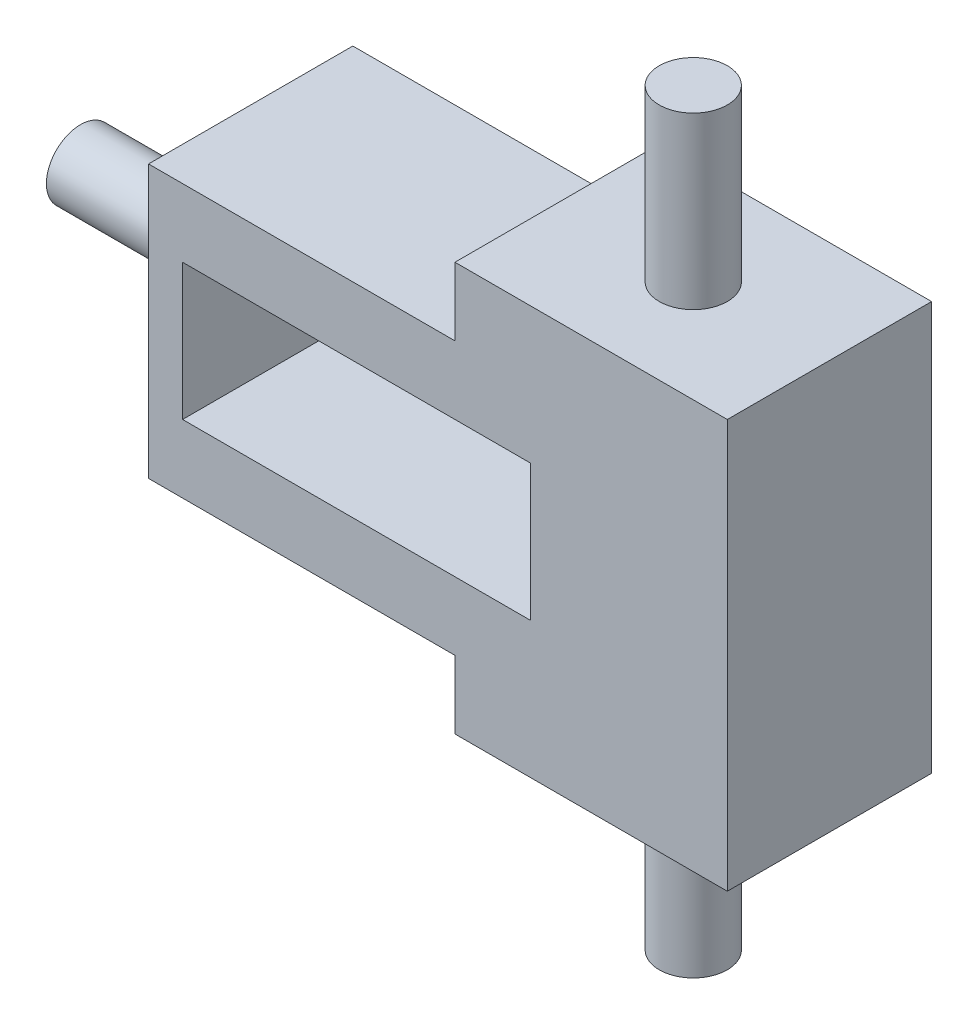
ISO-10303-21;
HEADER;
FILE_DESCRIPTION(('STEP AP214'),'2;1');
FILE_NAME('part.step','',(''),(''),'','','');
FILE_SCHEMA(('AUTOMOTIVE_DESIGN { 1 0 10303 214 1 1 1 1 }'));
ENDSEC;
DATA;
#1=APPLICATION_CONTEXT('core data for automotive mechanical design processes');
#2=APPLICATION_PROTOCOL_DEFINITION('international standard','automotive_design',2000,#1);
#3=PRODUCT_CONTEXT('',#1,'mechanical');
#4=PRODUCT('Part','Part','',(#3));
#5=PRODUCT_RELATED_PRODUCT_CATEGORY('part','',(#4));
#6=PRODUCT_DEFINITION_FORMATION('','',#4);
#7=PRODUCT_DEFINITION_CONTEXT('part definition',#1,'design');
#8=PRODUCT_DEFINITION('design','',#6,#7);
#9=PRODUCT_DEFINITION_SHAPE('','',#8);
#10=(LENGTH_UNIT() NAMED_UNIT(*) SI_UNIT(.MILLI.,.METRE.));
#11=(NAMED_UNIT(*) PLANE_ANGLE_UNIT() SI_UNIT($,.RADIAN.));
#12=(NAMED_UNIT(*) SI_UNIT($,.STERADIAN.) SOLID_ANGLE_UNIT());
#13=UNCERTAINTY_MEASURE_WITH_UNIT(LENGTH_MEASURE(1.E-05),#10,'distance_accuracy_value','');
#14=(GEOMETRIC_REPRESENTATION_CONTEXT(3) GLOBAL_UNCERTAINTY_ASSIGNED_CONTEXT((#13)) GLOBAL_UNIT_ASSIGNED_CONTEXT((#10,
#11,#12)) REPRESENTATION_CONTEXT('',''));
#15=CARTESIAN_POINT('',(0.,0.,0.));
#16=DIRECTION('',(0.,0.,1.));
#17=DIRECTION('',(1.,0.,0.));
#18=AXIS2_PLACEMENT_3D('',#15,#16,#17);
#19=CARTESIAN_POINT('',(0.,0.,3.));
#20=DIRECTION('',(0.,0.,1.));
#21=DIRECTION('',(1.,0.,0.));
#22=AXIS2_PLACEMENT_3D('',#19,#20,#21);
#23=PLANE('',#22);
#24=DIRECTION('',(-1.,0.,0.));
#25=VECTOR('',#24,1.);
#26=CARTESIAN_POINT('',(-2.5,2.,3.));
#27=LINE('',#26,#25);
#28=CARTESIAN_POINT('',(2.,2.,3.));
#29=VERTEX_POINT('',#28);
#30=CARTESIAN_POINT('',(-2.5,2.,3.));
#31=VERTEX_POINT('',#30);
#32=EDGE_CURVE('E181',#29,#31,#27,.T.);
#33=ORIENTED_EDGE('',*,*,#32,.T.);
#34=DIRECTION('',(0.,-1.,0.));
#35=VECTOR('',#34,1.);
#36=CARTESIAN_POINT('',(-2.5,0.50354609929078,3.));
#37=LINE('',#36,#35);
#38=CARTESIAN_POINT('',(-2.5,-2.,3.));
#39=VERTEX_POINT('',#38);
#40=EDGE_CURVE('E185',#31,#39,#37,.T.);
#41=ORIENTED_EDGE('',*,*,#40,.T.);
#42=DIRECTION('',(1.,0.,0.));
#43=VECTOR('',#42,1.);
#44=CARTESIAN_POINT('',(-2.,-2.,3.));
#45=LINE('',#44,#43);
#46=CARTESIAN_POINT('',(2.,-2.,3.));
#47=VERTEX_POINT('',#46);
#48=EDGE_CURVE('E189',#39,#47,#45,.T.);
#49=ORIENTED_EDGE('',*,*,#48,.T.);
#50=DIRECTION('',(0.,-1.,0.));
#51=VECTOR('',#50,1.);
#52=CARTESIAN_POINT('',(2.,-3.,3.));
#53=LINE('',#52,#51);
#54=CARTESIAN_POINT('',(2.,-3.,3.));
#55=VERTEX_POINT('',#54);
#56=EDGE_CURVE('E192',#47,#55,#53,.T.);
#57=ORIENTED_EDGE('',*,*,#56,.T.);
#58=DIRECTION('',(1.,0.,0.));
#59=VECTOR('',#58,1.);
#60=CARTESIAN_POINT('',(6.,-3.,3.));
#61=LINE('',#60,#59);
#62=CARTESIAN_POINT('',(6.,-3.,3.));
#63=VERTEX_POINT('',#62);
#64=EDGE_CURVE('E195',#55,#63,#61,.T.);
#65=ORIENTED_EDGE('',*,*,#64,.T.);
#66=DIRECTION('',(0.,1.,0.));
#67=VECTOR('',#66,1.);
#68=CARTESIAN_POINT('',(6.,3.,3.));
#69=LINE('',#68,#67);
#70=CARTESIAN_POINT('',(6.,3.,3.));
#71=VERTEX_POINT('',#70);
#72=EDGE_CURVE('E198',#63,#71,#69,.T.);
#73=ORIENTED_EDGE('',*,*,#72,.T.);
#74=DIRECTION('',(-1.,0.,0.));
#75=VECTOR('',#74,1.);
#76=CARTESIAN_POINT('',(2.,3.,3.));
#77=LINE('',#76,#75);
#78=CARTESIAN_POINT('',(2.,3.,3.));
#79=VERTEX_POINT('',#78);
#80=EDGE_CURVE('E201',#71,#79,#77,.T.);
#81=ORIENTED_EDGE('',*,*,#80,.T.);
#82=DIRECTION('',(0.,-1.,0.));
#83=VECTOR('',#82,1.);
#84=CARTESIAN_POINT('',(2.,2.,3.));
#85=LINE('',#84,#83);
#86=EDGE_CURVE('E204',#79,#29,#85,.T.);
#87=ORIENTED_EDGE('',*,*,#86,.T.);
#88=EDGE_LOOP('',(#33,#41,#49,#57,#65,#73,#81,#87));
#89=FACE_BOUND('',#88,.T.);
#90=DIRECTION('',(0.,-1.,0.));
#91=VECTOR('',#90,1.);
#92=CARTESIAN_POINT('',(-2.,1.,3.));
#93=LINE('',#92,#91);
#94=CARTESIAN_POINT('',(-2.,1.,3.));
#95=VERTEX_POINT('',#94);
#96=CARTESIAN_POINT('',(-2.,-1.,3.));
#97=VERTEX_POINT('',#96);
#98=EDGE_CURVE('E140',#95,#97,#93,.T.);
#99=ORIENTED_EDGE('',*,*,#98,.F.);
#100=DIRECTION('',(-1.,0.,0.));
#101=VECTOR('',#100,1.);
#102=CARTESIAN_POINT('',(-2.,1.,3.));
#103=LINE('',#102,#101);
#104=CARTESIAN_POINT('',(3.10638297872341,1.,3.));
#105=VERTEX_POINT('',#104);
#106=EDGE_CURVE('E131',#105,#95,#103,.T.);
#107=ORIENTED_EDGE('',*,*,#106,.F.);
#108=DIRECTION('',(0.,1.,0.));
#109=VECTOR('',#108,1.);
#110=CARTESIAN_POINT('',(3.10638297872341,1.,3.));
#111=LINE('',#110,#109);
#112=CARTESIAN_POINT('',(3.10638297872341,-1.,3.));
#113=VERTEX_POINT('',#112);
#114=EDGE_CURVE('E157',#113,#105,#111,.T.);
#115=ORIENTED_EDGE('',*,*,#114,.F.);
#116=DIRECTION('',(1.,0.,0.));
#117=VECTOR('',#116,1.);
#118=CARTESIAN_POINT('',(3.10638297872341,-1.,3.));
#119=LINE('',#118,#117);
#120=EDGE_CURVE('E153',#97,#113,#119,.T.);
#121=ORIENTED_EDGE('',*,*,#120,.F.);
#122=EDGE_LOOP('',(#99,#107,#115,#121));
#123=FACE_BOUND('',#122,.T.);
#124=ADVANCED_FACE('F39',(#89,#123),#23,.T.);
#125=CARTESIAN_POINT('',(0.,0.,0.));
#126=DIRECTION('',(0.,0.,1.));
#127=DIRECTION('',(1.,0.,0.));
#128=AXIS2_PLACEMENT_3D('',#125,#126,#127);
#129=PLANE('',#128);
#130=DIRECTION('',(0.,-1.,0.));
#131=VECTOR('',#130,1.);
#132=CARTESIAN_POINT('',(-2.5,-2.,0.));
#133=LINE('',#132,#131);
#134=CARTESIAN_POINT('',(-2.5,2.,0.));
#135=VERTEX_POINT('',#134);
#136=CARTESIAN_POINT('',(-2.5,-2.,0.));
#137=VERTEX_POINT('',#136);
#138=EDGE_CURVE('E149',#135,#137,#133,.T.);
#139=ORIENTED_EDGE('',*,*,#138,.F.);
#140=DIRECTION('',(-1.,0.,0.));
#141=VECTOR('',#140,1.);
#142=CARTESIAN_POINT('',(-2.,2.,0.));
#143=LINE('',#142,#141);
#144=CARTESIAN_POINT('',(2.,2.,0.));
#145=VERTEX_POINT('',#144);
#146=EDGE_CURVE('E186',#145,#135,#143,.T.);
#147=ORIENTED_EDGE('',*,*,#146,.F.);
#148=DIRECTION('',(0.,-1.,0.));
#149=VECTOR('',#148,1.);
#150=CARTESIAN_POINT('',(2.,2.,0.));
#151=LINE('',#150,#149);
#152=CARTESIAN_POINT('',(2.,3.,0.));
#153=VERTEX_POINT('',#152);
#154=EDGE_CURVE('E227',#153,#145,#151,.T.);
#155=ORIENTED_EDGE('',*,*,#154,.F.);
#156=DIRECTION('',(-1.,0.,0.));
#157=VECTOR('',#156,1.);
#158=CARTESIAN_POINT('',(2.,3.,0.));
#159=LINE('',#158,#157);
#160=CARTESIAN_POINT('',(6.,3.,0.));
#161=VERTEX_POINT('',#160);
#162=EDGE_CURVE('E224',#161,#153,#159,.T.);
#163=ORIENTED_EDGE('',*,*,#162,.F.);
#164=DIRECTION('',(0.,1.,0.));
#165=VECTOR('',#164,1.);
#166=CARTESIAN_POINT('',(6.,3.,0.));
#167=LINE('',#166,#165);
#168=CARTESIAN_POINT('',(6.,-3.,0.));
#169=VERTEX_POINT('',#168);
#170=EDGE_CURVE('E221',#169,#161,#167,.T.);
#171=ORIENTED_EDGE('',*,*,#170,.F.);
#172=DIRECTION('',(1.,0.,0.));
#173=VECTOR('',#172,1.);
#174=CARTESIAN_POINT('',(6.,-3.,0.));
#175=LINE('',#174,#173);
#176=CARTESIAN_POINT('',(2.,-3.,0.));
#177=VERTEX_POINT('',#176);
#178=EDGE_CURVE('E218',#177,#169,#175,.T.);
#179=ORIENTED_EDGE('',*,*,#178,.F.);
#180=DIRECTION('',(0.,-1.,0.));
#181=VECTOR('',#180,1.);
#182=CARTESIAN_POINT('',(2.,-3.,0.));
#183=LINE('',#182,#181);
#184=CARTESIAN_POINT('',(2.,-2.,0.));
#185=VERTEX_POINT('',#184);
#186=EDGE_CURVE('E215',#185,#177,#183,.T.);
#187=ORIENTED_EDGE('',*,*,#186,.F.);
#188=DIRECTION('',(1.,0.,0.));
#189=VECTOR('',#188,1.);
#190=CARTESIAN_POINT('',(2.,-2.,0.));
#191=LINE('',#190,#189);
#192=EDGE_CURVE('E212',#137,#185,#191,.T.);
#193=ORIENTED_EDGE('',*,*,#192,.F.);
#194=EDGE_LOOP('',(#139,#147,#155,#163,#171,#179,#187,#193));
#195=FACE_BOUND('',#194,.T.);
#196=DIRECTION('',(-1.,0.,0.));
#197=VECTOR('',#196,1.);
#198=CARTESIAN_POINT('',(-2.,1.,0.));
#199=LINE('',#198,#197);
#200=CARTESIAN_POINT('',(3.10638297872341,1.,0.));
#201=VERTEX_POINT('',#200);
#202=CARTESIAN_POINT('',(-2.,1.,0.));
#203=VERTEX_POINT('',#202);
#204=EDGE_CURVE('E65',#201,#203,#199,.T.);
#205=ORIENTED_EDGE('',*,*,#204,.T.);
#206=DIRECTION('',(0.,-1.,0.));
#207=VECTOR('',#206,1.);
#208=CARTESIAN_POINT('',(-2.,1.,0.));
#209=LINE('',#208,#207);
#210=CARTESIAN_POINT('',(-2.,-1.,0.));
#211=VERTEX_POINT('',#210);
#212=EDGE_CURVE('E147',#203,#211,#209,.T.);
#213=ORIENTED_EDGE('',*,*,#212,.T.);
#214=DIRECTION('',(1.,0.,0.));
#215=VECTOR('',#214,1.);
#216=CARTESIAN_POINT('',(3.10638297872341,-1.,0.));
#217=LINE('',#216,#215);
#218=CARTESIAN_POINT('',(3.10638297872341,-1.,0.));
#219=VERTEX_POINT('',#218);
#220=EDGE_CURVE('E168',#211,#219,#217,.T.);
#221=ORIENTED_EDGE('',*,*,#220,.T.);
#222=DIRECTION('',(0.,1.,0.));
#223=VECTOR('',#222,1.);
#224=CARTESIAN_POINT('',(3.10638297872341,1.,0.));
#225=LINE('',#224,#223);
#226=EDGE_CURVE('E141',#219,#201,#225,.T.);
#227=ORIENTED_EDGE('',*,*,#226,.T.);
#228=EDGE_LOOP('',(#205,#213,#221,#227));
#229=FACE_BOUND('',#228,.T.);
#230=ADVANCED_FACE('F270',(#195,#229),#129,.F.);
#231=CARTESIAN_POINT('',(-2.5,-2.,3.));
#232=DIRECTION('',(1.,0.,0.));
#233=DIRECTION('',(0.,0.,-1.));
#234=AXIS2_PLACEMENT_3D('',#231,#232,#233);
#235=PLANE('',#234);
#236=CARTESIAN_POINT('',(-2.5,0.,1.5));
#237=DIRECTION('',(-1.,0.,0.));
#238=DIRECTION('',(0.,0.,1.));
#239=AXIS2_PLACEMENT_3D('',#236,#237,#238);
#240=CIRCLE('',#239,0.5);
#241=CARTESIAN_POINT('',(-2.5,0.,2.));
#242=VERTEX_POINT('',#241);
#243=EDGE_CURVE('E11',#242,#242,#240,.T.);
#244=ORIENTED_EDGE('',*,*,#243,.F.);
#245=EDGE_LOOP('',(#244));
#246=FACE_BOUND('',#245,.T.);
#247=ORIENTED_EDGE('',*,*,#138,.T.);
#248=DIRECTION('',(0.,0.,-1.));
#249=VECTOR('',#248,1.);
#250=CARTESIAN_POINT('',(-2.5,-2.,3.));
#251=LINE('',#250,#249);
#252=EDGE_CURVE('E256',#39,#137,#251,.T.);
#253=ORIENTED_EDGE('',*,*,#252,.F.);
#254=ORIENTED_EDGE('',*,*,#40,.F.);
#255=DIRECTION('',(0.,0.,-1.));
#256=VECTOR('',#255,1.);
#257=CARTESIAN_POINT('',(-2.5,2.,3.));
#258=LINE('',#257,#256);
#259=EDGE_CURVE('E49',#31,#135,#258,.T.);
#260=ORIENTED_EDGE('',*,*,#259,.T.);
#261=EDGE_LOOP('',(#247,#253,#254,#260));
#262=FACE_BOUND('',#261,.T.);
#263=ADVANCED_FACE('F41',(#246,#262),#235,.F.);
#264=CARTESIAN_POINT('',(2.,-2.,3.));
#265=DIRECTION('',(0.,1.,0.));
#266=DIRECTION('',(0.,0.,1.));
#267=AXIS2_PLACEMENT_3D('',#264,#265,#266);
#268=PLANE('',#267);
#269=ORIENTED_EDGE('',*,*,#192,.T.);
#270=DIRECTION('',(0.,0.,-1.));
#271=VECTOR('',#270,1.);
#272=CARTESIAN_POINT('',(2.,-2.,3.));
#273=LINE('',#272,#271);
#274=EDGE_CURVE('E252',#47,#185,#273,.T.);
#275=ORIENTED_EDGE('',*,*,#274,.F.);
#276=ORIENTED_EDGE('',*,*,#48,.F.);
#277=ORIENTED_EDGE('',*,*,#252,.T.);
#278=EDGE_LOOP('',(#269,#275,#276,#277));
#279=FACE_BOUND('',#278,.T.);
#280=ADVANCED_FACE('F277',(#279),#268,.F.);
#281=CARTESIAN_POINT('',(2.,-3.,3.));
#282=DIRECTION('',(1.,0.,0.));
#283=DIRECTION('',(0.,0.,-1.));
#284=AXIS2_PLACEMENT_3D('',#281,#282,#283);
#285=PLANE('',#284);
#286=ORIENTED_EDGE('',*,*,#186,.T.);
#287=DIRECTION('',(0.,0.,-1.));
#288=VECTOR('',#287,1.);
#289=CARTESIAN_POINT('',(2.,-3.,3.));
#290=LINE('',#289,#288);
#291=EDGE_CURVE('E248',#55,#177,#290,.T.);
#292=ORIENTED_EDGE('',*,*,#291,.F.);
#293=ORIENTED_EDGE('',*,*,#56,.F.);
#294=ORIENTED_EDGE('',*,*,#274,.T.);
#295=EDGE_LOOP('',(#286,#292,#293,#294));
#296=FACE_BOUND('',#295,.T.);
#297=ADVANCED_FACE('F281',(#296),#285,.F.);
#298=CARTESIAN_POINT('',(6.,-3.,3.));
#299=DIRECTION('',(0.,1.,0.));
#300=DIRECTION('',(0.,0.,1.));
#301=AXIS2_PLACEMENT_3D('',#298,#299,#300);
#302=PLANE('',#301);
#303=CARTESIAN_POINT('',(4.,-3.,1.5));
#304=DIRECTION('',(0.,1.,0.));
#305=DIRECTION('',(0.,0.,1.));
#306=AXIS2_PLACEMENT_3D('',#303,#304,#305);
#307=CIRCLE('',#306,0.500000000000001);
#308=CARTESIAN_POINT('',(4.,-3.,2.));
#309=VERTEX_POINT('',#308);
#310=EDGE_CURVE('E165',#309,#309,#307,.T.);
#311=ORIENTED_EDGE('',*,*,#310,.T.);
#312=EDGE_LOOP('',(#311));
#313=FACE_BOUND('',#312,.T.);
#314=ORIENTED_EDGE('',*,*,#178,.T.);
#315=DIRECTION('',(0.,0.,-1.));
#316=VECTOR('',#315,1.);
#317=CARTESIAN_POINT('',(6.,-3.,3.));
#318=LINE('',#317,#316);
#319=EDGE_CURVE('E244',#63,#169,#318,.T.);
#320=ORIENTED_EDGE('',*,*,#319,.F.);
#321=ORIENTED_EDGE('',*,*,#64,.F.);
#322=ORIENTED_EDGE('',*,*,#291,.T.);
#323=EDGE_LOOP('',(#314,#320,#321,#322));
#324=FACE_BOUND('',#323,.T.);
#325=ADVANCED_FACE('F299',(#313,#324),#302,.F.);
#326=CARTESIAN_POINT('',(6.,3.,3.));
#327=DIRECTION('',(-1.,0.,0.));
#328=DIRECTION('',(0.,0.,1.));
#329=AXIS2_PLACEMENT_3D('',#326,#327,#328);
#330=PLANE('',#329);
#331=ORIENTED_EDGE('',*,*,#170,.T.);
#332=DIRECTION('',(0.,0.,-1.));
#333=VECTOR('',#332,1.);
#334=CARTESIAN_POINT('',(6.,3.,3.));
#335=LINE('',#334,#333);
#336=EDGE_CURVE('E240',#71,#161,#335,.T.);
#337=ORIENTED_EDGE('',*,*,#336,.F.);
#338=ORIENTED_EDGE('',*,*,#72,.F.);
#339=ORIENTED_EDGE('',*,*,#319,.T.);
#340=EDGE_LOOP('',(#331,#337,#338,#339));
#341=FACE_BOUND('',#340,.T.);
#342=ADVANCED_FACE('F296',(#341),#330,.F.);
#343=CARTESIAN_POINT('',(2.,3.,3.));
#344=DIRECTION('',(0.,-1.,0.));
#345=DIRECTION('',(1.,0.,0.));
#346=AXIS2_PLACEMENT_3D('',#343,#344,#345);
#347=PLANE('',#346);
#348=CARTESIAN_POINT('',(4.,3.,1.5));
#349=DIRECTION('',(0.,-1.,0.));
#350=DIRECTION('',(1.,0.,0.));
#351=AXIS2_PLACEMENT_3D('',#348,#349,#350);
#352=CIRCLE('',#351,0.500000000000001);
#353=CARTESIAN_POINT('',(4.5,3.,1.5));
#354=VERTEX_POINT('',#353);
#355=EDGE_CURVE('E43',#354,#354,#352,.T.);
#356=ORIENTED_EDGE('',*,*,#355,.T.);
#357=EDGE_LOOP('',(#356));
#358=FACE_BOUND('',#357,.T.);
#359=ORIENTED_EDGE('',*,*,#162,.T.);
#360=DIRECTION('',(0.,0.,-1.));
#361=VECTOR('',#360,1.);
#362=CARTESIAN_POINT('',(2.,3.,3.));
#363=LINE('',#362,#361);
#364=EDGE_CURVE('E236',#79,#153,#363,.T.);
#365=ORIENTED_EDGE('',*,*,#364,.F.);
#366=ORIENTED_EDGE('',*,*,#80,.F.);
#367=ORIENTED_EDGE('',*,*,#336,.T.);
#368=EDGE_LOOP('',(#359,#365,#366,#367));
#369=FACE_BOUND('',#368,.T.);
#370=ADVANCED_FACE('F292',(#358,#369),#347,.F.);
#371=CARTESIAN_POINT('',(2.,2.,3.));
#372=DIRECTION('',(1.,0.,0.));
#373=DIRECTION('',(0.,0.,-1.));
#374=AXIS2_PLACEMENT_3D('',#371,#372,#373);
#375=PLANE('',#374);
#376=ORIENTED_EDGE('',*,*,#154,.T.);
#377=DIRECTION('',(0.,0.,-1.));
#378=VECTOR('',#377,1.);
#379=CARTESIAN_POINT('',(2.,2.,3.));
#380=LINE('',#379,#378);
#381=EDGE_CURVE('E208',#29,#145,#380,.T.);
#382=ORIENTED_EDGE('',*,*,#381,.F.);
#383=ORIENTED_EDGE('',*,*,#86,.F.);
#384=ORIENTED_EDGE('',*,*,#364,.T.);
#385=EDGE_LOOP('',(#376,#382,#383,#384));
#386=FACE_BOUND('',#385,.T.);
#387=ADVANCED_FACE('F290',(#386),#375,.F.);
#388=CARTESIAN_POINT('',(-2.,2.,3.));
#389=DIRECTION('',(0.,-1.,0.));
#390=DIRECTION('',(0.,0.,-1.));
#391=AXIS2_PLACEMENT_3D('',#388,#389,#390);
#392=PLANE('',#391);
#393=ORIENTED_EDGE('',*,*,#146,.T.);
#394=ORIENTED_EDGE('',*,*,#259,.F.);
#395=ORIENTED_EDGE('',*,*,#32,.F.);
#396=ORIENTED_EDGE('',*,*,#381,.T.);
#397=EDGE_LOOP('',(#393,#394,#395,#396));
#398=FACE_BOUND('',#397,.T.);
#399=ADVANCED_FACE('F265',(#398),#392,.F.);
#400=CARTESIAN_POINT('',(-2.,1.,3.));
#401=DIRECTION('',(0.,-1.,0.));
#402=DIRECTION('',(0.,0.,-1.));
#403=AXIS2_PLACEMENT_3D('',#400,#401,#402);
#404=PLANE('',#403);
#405=ORIENTED_EDGE('',*,*,#204,.F.);
#406=DIRECTION('',(0.,0.,-1.));
#407=VECTOR('',#406,1.);
#408=CARTESIAN_POINT('',(3.10638297872341,1.,3.));
#409=LINE('',#408,#407);
#410=EDGE_CURVE('E135',#105,#201,#409,.T.);
#411=ORIENTED_EDGE('',*,*,#410,.F.);
#412=ORIENTED_EDGE('',*,*,#106,.T.);
#413=DIRECTION('',(0.,0.,-1.));
#414=VECTOR('',#413,1.);
#415=CARTESIAN_POINT('',(-2.,1.,3.));
#416=LINE('',#415,#414);
#417=EDGE_CURVE('E134',#95,#203,#416,.T.);
#418=ORIENTED_EDGE('',*,*,#417,.T.);
#419=EDGE_LOOP('',(#405,#411,#412,#418));
#420=FACE_BOUND('',#419,.T.);
#421=ADVANCED_FACE('F133',(#420),#404,.T.);
#422=CARTESIAN_POINT('',(-2.,1.,3.));
#423=DIRECTION('',(1.,0.,0.));
#424=DIRECTION('',(0.,0.,-1.));
#425=AXIS2_PLACEMENT_3D('',#422,#423,#424);
#426=PLANE('',#425);
#427=ORIENTED_EDGE('',*,*,#212,.F.);
#428=ORIENTED_EDGE('',*,*,#417,.F.);
#429=ORIENTED_EDGE('',*,*,#98,.T.);
#430=DIRECTION('',(0.,0.,-1.));
#431=VECTOR('',#430,1.);
#432=CARTESIAN_POINT('',(-2.,-1.,3.));
#433=LINE('',#432,#431);
#434=EDGE_CURVE('E150',#97,#211,#433,.T.);
#435=ORIENTED_EDGE('',*,*,#434,.T.);
#436=EDGE_LOOP('',(#427,#428,#429,#435));
#437=FACE_BOUND('',#436,.T.);
#438=ADVANCED_FACE('F144',(#437),#426,.T.);
#439=CARTESIAN_POINT('',(3.10638297872341,-1.,3.));
#440=DIRECTION('',(0.,1.,0.));
#441=DIRECTION('',(0.,0.,1.));
#442=AXIS2_PLACEMENT_3D('',#439,#440,#441);
#443=PLANE('',#442);
#444=ORIENTED_EDGE('',*,*,#220,.F.);
#445=ORIENTED_EDGE('',*,*,#434,.F.);
#446=ORIENTED_EDGE('',*,*,#120,.T.);
#447=DIRECTION('',(0.,0.,-1.));
#448=VECTOR('',#447,1.);
#449=CARTESIAN_POINT('',(3.10638297872341,-1.,3.));
#450=LINE('',#449,#448);
#451=EDGE_CURVE('E57',#113,#219,#450,.T.);
#452=ORIENTED_EDGE('',*,*,#451,.T.);
#453=EDGE_LOOP('',(#444,#445,#446,#452));
#454=FACE_BOUND('',#453,.T.);
#455=ADVANCED_FACE('F405',(#454),#443,.T.);
#456=CARTESIAN_POINT('',(3.10638297872341,1.,3.));
#457=DIRECTION('',(-1.,0.,0.));
#458=DIRECTION('',(0.,0.,1.));
#459=AXIS2_PLACEMENT_3D('',#456,#457,#458);
#460=PLANE('',#459);
#461=ORIENTED_EDGE('',*,*,#226,.F.);
#462=ORIENTED_EDGE('',*,*,#451,.F.);
#463=ORIENTED_EDGE('',*,*,#114,.T.);
#464=ORIENTED_EDGE('',*,*,#410,.T.);
#465=EDGE_LOOP('',(#461,#462,#463,#464));
#466=FACE_BOUND('',#465,.T.);
#467=ADVANCED_FACE('F413',(#466),#460,.T.);
#468=CARTESIAN_POINT('',(4.,5.5,1.5));
#469=DIRECTION('',(0.,1.,0.));
#470=DIRECTION('',(-1.,0.,0.));
#471=AXIS2_PLACEMENT_3D('',#468,#469,#470);
#472=PLANE('',#471);
#473=CARTESIAN_POINT('',(4.,5.5,1.5));
#474=DIRECTION('',(0.,1.,0.));
#475=DIRECTION('',(-1.,0.,0.));
#476=AXIS2_PLACEMENT_3D('',#473,#474,#475);
#477=CIRCLE('',#476,0.500000000000001);
#478=CARTESIAN_POINT('',(3.5,5.5,1.5));
#479=VERTEX_POINT('',#478);
#480=EDGE_CURVE('E335',#479,#479,#477,.T.);
#481=ORIENTED_EDGE('',*,*,#480,.T.);
#482=EDGE_LOOP('',(#481));
#483=FACE_BOUND('',#482,.T.);
#484=ADVANCED_FACE('F422',(#483),#472,.T.);
#485=CARTESIAN_POINT('',(4.,-5.5,1.5));
#486=DIRECTION('',(0.,1.,0.));
#487=DIRECTION('',(-1.,0.,0.));
#488=AXIS2_PLACEMENT_3D('',#485,#486,#487);
#489=CYLINDRICAL_SURFACE('',#488,0.500000000000001);
#490=ORIENTED_EDGE('',*,*,#480,.F.);
#491=EDGE_LOOP('',(#490));
#492=FACE_BOUND('',#491,.T.);
#493=ORIENTED_EDGE('',*,*,#355,.F.);
#494=EDGE_LOOP('',(#493));
#495=FACE_BOUND('',#494,.T.);
#496=ADVANCED_FACE('F438',(#492,#495),#489,.T.);
#497=CARTESIAN_POINT('',(4.,-5.5,1.5));
#498=DIRECTION('',(0.,1.,0.));
#499=DIRECTION('',(-1.,0.,0.));
#500=AXIS2_PLACEMENT_3D('',#497,#498,#499);
#501=CIRCLE('',#500,0.500000000000001);
#502=CARTESIAN_POINT('',(3.5,-5.5,1.5));
#503=VERTEX_POINT('',#502);
#504=EDGE_CURVE('E331',#503,#503,#501,.T.);
#505=ORIENTED_EDGE('',*,*,#504,.T.);
#506=EDGE_LOOP('',(#505));
#507=FACE_BOUND('',#506,.T.);
#508=ORIENTED_EDGE('',*,*,#310,.F.);
#509=EDGE_LOOP('',(#508));
#510=FACE_BOUND('',#509,.T.);
#511=ADVANCED_FACE('F448',(#507,#510),#489,.T.);
#512=CARTESIAN_POINT('',(4.,-5.5,1.5));
#513=DIRECTION('',(0.,1.,0.));
#514=DIRECTION('',(-1.,0.,0.));
#515=AXIS2_PLACEMENT_3D('',#512,#513,#514);
#516=PLANE('',#515);
#517=ORIENTED_EDGE('',*,*,#504,.F.);
#518=EDGE_LOOP('',(#517));
#519=FACE_BOUND('',#518,.T.);
#520=ADVANCED_FACE('F353',(#519),#516,.F.);
#521=CARTESIAN_POINT('',(-5.,0.,1.5));
#522=DIRECTION('',(1.,0.,0.));
#523=DIRECTION('',(0.,0.,-1.));
#524=AXIS2_PLACEMENT_3D('',#521,#522,#523);
#525=CYLINDRICAL_SURFACE('',#524,0.5);
#526=CARTESIAN_POINT('',(-5.,0.,1.5));
#527=DIRECTION('',(-1.,0.,0.));
#528=DIRECTION('',(0.,0.,1.));
#529=AXIS2_PLACEMENT_3D('',#526,#527,#528);
#530=CIRCLE('',#529,0.5);
#531=CARTESIAN_POINT('',(-5.,0.,2.));
#532=VERTEX_POINT('',#531);
#533=EDGE_CURVE('E341',#532,#532,#530,.T.);
#534=ORIENTED_EDGE('',*,*,#533,.F.);
#535=EDGE_LOOP('',(#534));
#536=FACE_BOUND('',#535,.T.);
#537=ORIENTED_EDGE('',*,*,#243,.T.);
#538=EDGE_LOOP('',(#537));
#539=FACE_BOUND('',#538,.T.);
#540=ADVANCED_FACE('F350',(#536,#539),#525,.T.);
#541=CARTESIAN_POINT('',(-5.,0.,1.5));
#542=DIRECTION('',(-1.,0.,0.));
#543=DIRECTION('',(0.,0.,1.));
#544=AXIS2_PLACEMENT_3D('',#541,#542,#543);
#545=PLANE('',#544);
#546=ORIENTED_EDGE('',*,*,#533,.T.);
#547=EDGE_LOOP('',(#546));
#548=FACE_BOUND('',#547,.T.);
#549=ADVANCED_FACE('F348',(#548),#545,.T.);
#550=CLOSED_SHELL('',(#124,#230,#263,#280,#297,#325,#342,#370,#387,#399,#421,#438,#455,#467,
#484,#496,#511,#520,#540,#549));
#551=MANIFOLD_SOLID_BREP('B2',#550);
#552=ADVANCED_BREP_SHAPE_REPRESENTATION('',(#18,#551),#14);
#553=SHAPE_DEFINITION_REPRESENTATION(#9,#552);
ENDSEC;
END-ISO-10303-21;
